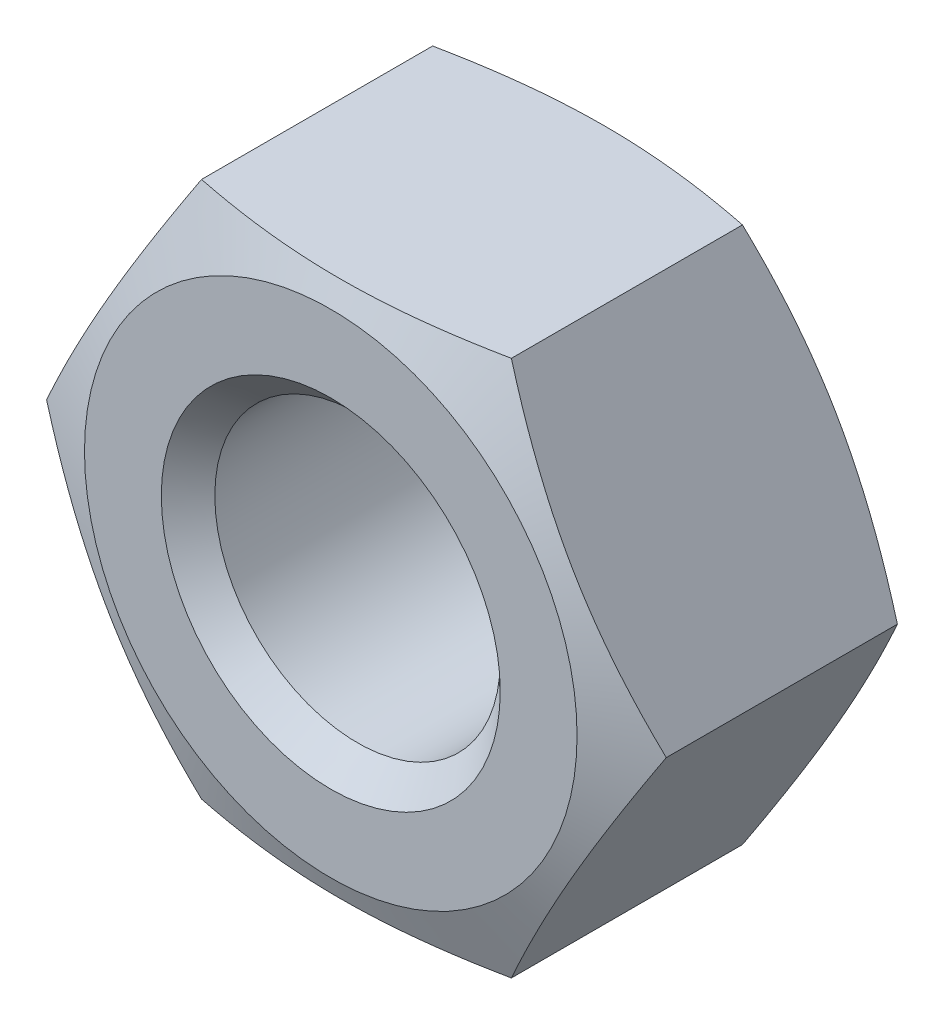
ISO-10303-21;
HEADER;
FILE_DESCRIPTION(('STEP AP214'),'2;1');
FILE_NAME('part.step','',(''),(''),'','','');
FILE_SCHEMA(('AUTOMOTIVE_DESIGN { 1 0 10303 214 1 1 1 1 }'));
ENDSEC;
DATA;
#1=APPLICATION_CONTEXT('core data for automotive mechanical design processes');
#2=APPLICATION_PROTOCOL_DEFINITION('international standard','automotive_design',2000,#1);
#3=PRODUCT_CONTEXT('',#1,'mechanical');
#4=PRODUCT('Part','Part','',(#3));
#5=PRODUCT_RELATED_PRODUCT_CATEGORY('part','',(#4));
#6=PRODUCT_DEFINITION_FORMATION('','',#4);
#7=PRODUCT_DEFINITION_CONTEXT('part definition',#1,'design');
#8=PRODUCT_DEFINITION('design','',#6,#7);
#9=PRODUCT_DEFINITION_SHAPE('','',#8);
#10=(LENGTH_UNIT() NAMED_UNIT(*) SI_UNIT(.MILLI.,.METRE.));
#11=(NAMED_UNIT(*) PLANE_ANGLE_UNIT() SI_UNIT($,.RADIAN.));
#12=(NAMED_UNIT(*) SI_UNIT($,.STERADIAN.) SOLID_ANGLE_UNIT());
#13=UNCERTAINTY_MEASURE_WITH_UNIT(LENGTH_MEASURE(1.E-05),#10,'distance_accuracy_value','');
#14=(GEOMETRIC_REPRESENTATION_CONTEXT(3) GLOBAL_UNCERTAINTY_ASSIGNED_CONTEXT((#13)) GLOBAL_UNIT_ASSIGNED_CONTEXT((#10,
#11,#12)) REPRESENTATION_CONTEXT('',''));
#15=CARTESIAN_POINT('',(0.,0.,0.));
#16=DIRECTION('',(0.,0.,1.));
#17=DIRECTION('',(1.,0.,0.));
#18=AXIS2_PLACEMENT_3D('',#15,#16,#17);
#19=CARTESIAN_POINT('',(-8.22723749999765,-4.74999778531182,-3.10862446895044E-12));
#20=DIRECTION('',(-0.866025403784438,-0.500000000000001,0.));
#21=DIRECTION('',(0.500000000000001,-0.866025403784438,0.));
#22=AXIS2_PLACEMENT_3D('',#19,#20,#21);
#23=PLANE('',#22);
#24=CARTESIAN_POINT('',(-10.9696499999969,3.10862446895044E-12,9.09090909090571));
#25=CARTESIAN_POINT('',(-8.22723750000031,-4.74999778531173,10.1989156629664));
#26=CARTESIAN_POINT('',(-5.48482499999881,-9.49999557062031,9.09090909090571));
#27=(BOUNDED_CURVE() B_SPLINE_CURVE(2,(#24,#25,#26),.UNSPECIFIED.,.F.,
.F.) B_SPLINE_CURVE_WITH_KNOTS((3,3),(0.,11.0337443691916),
.UNSPECIFIED.) CURVE() GEOMETRIC_REPRESENTATION_ITEM() RATIONAL_B_SPLINE_CURVE((1.,
1.15470053837925,1.)) REPRESENTATION_ITEM(''));
#28=CARTESIAN_POINT('',(-10.9696499999969,3.10862446895044E-12,9.09090909090571));
#29=VERTEX_POINT('',#28);
#30=CARTESIAN_POINT('',(-5.48482499999881,-9.49999557062031,9.09090909090571));
#31=VERTEX_POINT('',#30);
#32=EDGE_CURVE('E242',#29,#31,#27,.T.);
#33=ORIENTED_EDGE('',*,*,#32,.F.);
#34=DIRECTION('',(0.,0.,1.));
#35=VECTOR('',#34,1.);
#36=CARTESIAN_POINT('',(-10.9696500000003,2.22044604925031E-13,-3.10862446895044E-12));
#37=LINE('',#36,#35);
#38=CARTESIAN_POINT('',(-10.9696499999996,2.22044604925031E-13,0.909090909087862));
#39=VERTEX_POINT('',#38);
#40=EDGE_CURVE('E188',#39,#29,#37,.T.);
#41=ORIENTED_EDGE('',*,*,#40,.F.);
#42=CARTESIAN_POINT('',(-5.48482499999814,-9.49999557062475,0.909090909087418));
#43=CARTESIAN_POINT('',(-8.22723749999875,-4.74999778531152,-0.198915662963352));
#44=CARTESIAN_POINT('',(-10.9696499999996,2.22044604925031E-13,0.909090909087862));
#45=(BOUNDED_CURVE() B_SPLINE_CURVE(2,(#42,#43,#44),.UNSPECIFIED.,.F.,
.F.) B_SPLINE_CURVE_WITH_KNOTS((3,3),(0.,11.0337443691916),
.UNSPECIFIED.) CURVE() GEOMETRIC_REPRESENTATION_ITEM() RATIONAL_B_SPLINE_CURVE((1.,
1.15470053837925,1.)) REPRESENTATION_ITEM(''));
#46=CARTESIAN_POINT('',(-5.48482499999814,-9.49999557062475,0.909090909087418));
#47=VERTEX_POINT('',#46);
#48=EDGE_CURVE('E121',#47,#39,#45,.T.);
#49=ORIENTED_EDGE('',*,*,#48,.F.);
#50=DIRECTION('',(0.,0.,1.));
#51=VECTOR('',#50,1.);
#52=CARTESIAN_POINT('',(-5.48482499999992,-9.49999557062409,-3.5527136788005E-12));
#53=LINE('',#52,#51);
#54=EDGE_CURVE('E11',#47,#31,#53,.T.);
#55=ORIENTED_EDGE('',*,*,#54,.T.);
#56=EDGE_LOOP('',(#33,#41,#49,#55));
#57=FACE_BOUND('',#56,.T.);
#58=ADVANCED_FACE('F17',(#57),#23,.T.);
#59=CARTESIAN_POINT('',(1.33226762955019E-12,-9.49999557062098,4.44089209850063E-13));
#60=DIRECTION('',(0.,-1.,0.));
#61=DIRECTION('',(1.,0.,0.));
#62=AXIS2_PLACEMENT_3D('',#59,#60,#61);
#63=PLANE('',#62);
#64=CARTESIAN_POINT('',(-5.48482499999881,-9.49999557062031,9.09090909090571));
#65=CARTESIAN_POINT('',(4.99970298459727E-12,-9.4999955706271,10.1989156629643));
#66=CARTESIAN_POINT('',(5.48482500000391,-9.49999557062187,9.0909090909026));
#67=(BOUNDED_CURVE() B_SPLINE_CURVE(2,(#64,#65,#66),.UNSPECIFIED.,.F.,
.F.) B_SPLINE_CURVE_WITH_KNOTS((3,3),(0.,11.0337443691915),
.UNSPECIFIED.) CURVE() GEOMETRIC_REPRESENTATION_ITEM() RATIONAL_B_SPLINE_CURVE((1.,
1.15470053837925,1.)) REPRESENTATION_ITEM(''));
#68=CARTESIAN_POINT('',(5.48482500000391,-9.49999557062187,9.0909090909026));
#69=VERTEX_POINT('',#68);
#70=EDGE_CURVE('E145',#31,#69,#67,.T.);
#71=ORIENTED_EDGE('',*,*,#70,.F.);
#72=ORIENTED_EDGE('',*,*,#54,.F.);
#73=CARTESIAN_POINT('',(5.48482500000169,-9.4999955706252,0.909090909084309));
#74=CARTESIAN_POINT('',(4.4228141786822E-12,-9.49999557062651,-0.198915662968928));
#75=CARTESIAN_POINT('',(-5.48482499999814,-9.49999557062475,0.909090909087418));
#76=(BOUNDED_CURVE() B_SPLINE_CURVE(2,(#73,#74,#75),.UNSPECIFIED.,.F.,
.F.) B_SPLINE_CURVE_WITH_KNOTS((3,3),(0.,11.0337443691916),
.UNSPECIFIED.) CURVE() GEOMETRIC_REPRESENTATION_ITEM() RATIONAL_B_SPLINE_CURVE((1.,
1.15470053837925,1.)) REPRESENTATION_ITEM(''));
#77=CARTESIAN_POINT('',(5.48482500000169,-9.4999955706252,0.909090909084309));
#78=VERTEX_POINT('',#77);
#79=EDGE_CURVE('E115',#78,#47,#76,.T.);
#80=ORIENTED_EDGE('',*,*,#79,.F.);
#81=DIRECTION('',(0.,0.,1.));
#82=VECTOR('',#81,1.);
#83=CARTESIAN_POINT('',(5.48482500000058,-9.49999557062431,-6.66133814775094E-12));
#84=LINE('',#83,#82);
#85=EDGE_CURVE('E28',#78,#69,#84,.T.);
#86=ORIENTED_EDGE('',*,*,#85,.T.);
#87=EDGE_LOOP('',(#71,#72,#80,#86));
#88=FACE_BOUND('',#87,.T.);
#89=ADVANCED_FACE('F116',(#88),#63,.T.);
#90=CARTESIAN_POINT('',(0.,0.,0.));
#91=DIRECTION('',(0.,0.,1.));
#92=DIRECTION('',(1.,0.,0.));
#93=AXIS2_PLACEMENT_3D('',#90,#91,#92);
#94=PLANE('',#93);
#95=CARTESIAN_POINT('',(0.,0.,0.));
#96=DIRECTION('',(0.,0.,1.));
#97=DIRECTION('',(1.,0.,0.));
#98=AXIS2_PLACEMENT_3D('',#95,#96,#97);
#99=CIRCLE('',#98,8.71957104234883);
#100=CARTESIAN_POINT('',(8.71957104235177,6.66133814775094E-13,0.));
#101=VERTEX_POINT('',#100);
#102=EDGE_CURVE('E137',#101,#101,#99,.T.);
#103=ORIENTED_EDGE('',*,*,#102,.F.);
#104=EDGE_LOOP('',(#103));
#105=FACE_BOUND('',#104,.T.);
#106=CARTESIAN_POINT('',(0.,0.,0.));
#107=DIRECTION('',(0.,0.,-1.));
#108=DIRECTION('',(1.,0.,0.));
#109=AXIS2_PLACEMENT_3D('',#106,#107,#108);
#110=CIRCLE('',#109,6.);
#111=CARTESIAN_POINT('',(6.000000000002,1.33226762955019E-12,-2.66453525910038E-12));
#112=VERTEX_POINT('',#111);
#113=EDGE_CURVE('E21',#112,#112,#110,.T.);
#114=ORIENTED_EDGE('',*,*,#113,.F.);
#115=EDGE_LOOP('',(#114));
#116=FACE_BOUND('',#115,.T.);
#117=ADVANCED_FACE('F207',(#105,#116),#94,.F.);
#118=CARTESIAN_POINT('',(-2.22044604925031E-13,6.66133814775094E-13,10.0000000000002));
#119=DIRECTION('',(0.,0.,1.));
#120=DIRECTION('',(1.,0.,0.));
#121=AXIS2_PLACEMENT_3D('',#118,#119,#120);
#122=PLANE('',#121);
#123=CARTESIAN_POINT('',(-2.22044604925031E-13,6.66133814775094E-13,10.0000000000002));
#124=DIRECTION('',(0.,0.,-1.));
#125=DIRECTION('',(1.,0.,0.));
#126=AXIS2_PLACEMENT_3D('',#123,#124,#125);
#127=CIRCLE('',#126,8.71957104234883);
#128=CARTESIAN_POINT('',(8.71957104235155,3.10862446895044E-12,9.99999999999979));
#129=VERTEX_POINT('',#128);
#130=EDGE_CURVE('E139',#129,#129,#127,.T.);
#131=ORIENTED_EDGE('',*,*,#130,.F.);
#132=EDGE_LOOP('',(#131));
#133=FACE_BOUND('',#132,.T.);
#134=CARTESIAN_POINT('',(-2.22044604925031E-13,6.66133814775094E-13,10.0000000000002));
#135=DIRECTION('',(0.,0.,1.));
#136=DIRECTION('',(1.,0.,0.));
#137=AXIS2_PLACEMENT_3D('',#134,#135,#136);
#138=CIRCLE('',#137,6.);
#139=CARTESIAN_POINT('',(5.99999999999978,-4.44089209850063E-13,9.99999999999757));
#140=VERTEX_POINT('',#139);
#141=EDGE_CURVE('E185',#140,#140,#138,.T.);
#142=ORIENTED_EDGE('',*,*,#141,.F.);
#143=EDGE_LOOP('',(#142));
#144=FACE_BOUND('',#143,.T.);
#145=ADVANCED_FACE('F210',(#133,#144),#122,.T.);
#146=CARTESIAN_POINT('',(8.22723750000076,-4.74999778531227,-6.66133814775094E-12));
#147=DIRECTION('',(0.866025403784441,-0.500000000000002,0.));
#148=DIRECTION('',(0.500000000000002,0.866025403784441,0.));
#149=AXIS2_PLACEMENT_3D('',#146,#147,#148);
#150=PLANE('',#149);
#151=CARTESIAN_POINT('',(5.48482500000391,-9.49999557062187,9.0909090909026));
#152=CARTESIAN_POINT('',(8.22723750000334,-4.74999778530978,10.1989156629708));
#153=CARTESIAN_POINT('',(10.9696500000007,4.44089209850063E-13,9.09090909090882));
#154=(BOUNDED_CURVE() B_SPLINE_CURVE(2,(#151,#152,#153),.UNSPECIFIED.,.F.,
.F.) B_SPLINE_CURVE_WITH_KNOTS((3,3),(0.,11.0337443691916),
.UNSPECIFIED.) CURVE() GEOMETRIC_REPRESENTATION_ITEM() RATIONAL_B_SPLINE_CURVE((1.,
1.15470053837926,1.)) REPRESENTATION_ITEM(''));
#155=CARTESIAN_POINT('',(10.9696500000007,4.44089209850063E-13,9.09090909090882));
#156=VERTEX_POINT('',#155);
#157=EDGE_CURVE('E111',#69,#156,#154,.T.);
#158=ORIENTED_EDGE('',*,*,#157,.F.);
#159=ORIENTED_EDGE('',*,*,#85,.F.);
#160=CARTESIAN_POINT('',(10.9696499999998,-8.88178419700125E-13,0.909090909090526));
#161=CARTESIAN_POINT('',(8.22723750000547,-4.74999778531267,-0.19891566296989));
#162=CARTESIAN_POINT('',(5.48482500000169,-9.4999955706252,0.909090909084309));
#163=(BOUNDED_CURVE() B_SPLINE_CURVE(2,(#160,#161,#162),.UNSPECIFIED.,.F.,
.F.) B_SPLINE_CURVE_WITH_KNOTS((3,3),(0.,11.0337443691916),
.UNSPECIFIED.) CURVE() GEOMETRIC_REPRESENTATION_ITEM() RATIONAL_B_SPLINE_CURVE((1.,
1.15470053837925,1.)) REPRESENTATION_ITEM(''));
#164=CARTESIAN_POINT('',(10.9696499999998,-8.88178419700125E-13,0.909090909090526));
#165=VERTEX_POINT('',#164);
#166=EDGE_CURVE('E109',#165,#78,#163,.T.);
#167=ORIENTED_EDGE('',*,*,#166,.F.);
#168=DIRECTION('',(0.,0.,1.));
#169=VECTOR('',#168,1.);
#170=CARTESIAN_POINT('',(10.9696500000005,4.44089209850063E-13,0.));
#171=LINE('',#170,#169);
#172=EDGE_CURVE('E76',#165,#156,#171,.T.);
#173=ORIENTED_EDGE('',*,*,#172,.T.);
#174=EDGE_LOOP('',(#158,#159,#167,#173));
#175=FACE_BOUND('',#174,.T.);
#176=ADVANCED_FACE('F107',(#175),#150,.T.);
#177=CARTESIAN_POINT('',(8.22723749999987,4.7499977853116,0.));
#178=DIRECTION('',(0.866025403784438,0.500000000000001,0.));
#179=DIRECTION('',(-0.500000000000001,0.866025403784438,0.));
#180=AXIS2_PLACEMENT_3D('',#177,#178,#179);
#181=PLANE('',#180);
#182=CARTESIAN_POINT('',(10.9696500000007,4.44089209850063E-13,9.09090909090882));
#183=CARTESIAN_POINT('',(8.22723750000222,4.74999778530479,10.1989156629687));
#184=CARTESIAN_POINT('',(5.48482500000236,9.49999557062609,9.09090909091259));
#185=(BOUNDED_CURVE() B_SPLINE_CURVE(2,(#182,#183,#184),.UNSPECIFIED.,.F.,
.F.) B_SPLINE_CURVE_WITH_KNOTS((3,3),(0.,11.0337443691916),
.UNSPECIFIED.) CURVE() GEOMETRIC_REPRESENTATION_ITEM() RATIONAL_B_SPLINE_CURVE((1.,
1.15470053837925,1.)) REPRESENTATION_ITEM(''));
#186=CARTESIAN_POINT('',(5.48482500000258,9.49999557062564,9.09090909091259));
#187=VERTEX_POINT('',#186);
#188=EDGE_CURVE('E178',#156,#187,#185,.T.);
#189=ORIENTED_EDGE('',*,*,#188,.F.);
#190=ORIENTED_EDGE('',*,*,#172,.F.);
#191=CARTESIAN_POINT('',(5.48482500000191,9.49999557062298,0.909090909094301));
#192=CARTESIAN_POINT('',(8.22723750000355,4.74999778530921,-0.198915662970274));
#193=CARTESIAN_POINT('',(10.9696499999998,-8.88178419700125E-13,0.909090909090526));
#194=(BOUNDED_CURVE() B_SPLINE_CURVE(2,(#191,#192,#193),.UNSPECIFIED.,.F.,
.F.) B_SPLINE_CURVE_WITH_KNOTS((3,3),(0.,11.0337443691916),
.UNSPECIFIED.) CURVE() GEOMETRIC_REPRESENTATION_ITEM() RATIONAL_B_SPLINE_CURVE((1.,
1.15470053837925,1.)) REPRESENTATION_ITEM(''));
#195=CARTESIAN_POINT('',(5.48482500000191,9.49999557062298,0.909090909094301));
#196=VERTEX_POINT('',#195);
#197=EDGE_CURVE('E127',#196,#165,#194,.T.);
#198=ORIENTED_EDGE('',*,*,#197,.F.);
#199=DIRECTION('',(0.,0.,1.));
#200=VECTOR('',#199,1.);
#201=CARTESIAN_POINT('',(5.48482500000302,9.4999955706232,3.33066907387547E-12));
#202=LINE('',#201,#200);
#203=EDGE_CURVE('E186',#196,#187,#202,.T.);
#204=ORIENTED_EDGE('',*,*,#203,.T.);
#205=EDGE_LOOP('',(#189,#190,#198,#204));
#206=FACE_BOUND('',#205,.T.);
#207=ADVANCED_FACE('F282',(#206),#181,.T.);
#208=CARTESIAN_POINT('',(2.44249065417534E-12,9.49999557062342,-6.21724893790088E-12));
#209=DIRECTION('',(0.,1.,0.));
#210=DIRECTION('',(-1.,0.,0.));
#211=AXIS2_PLACEMENT_3D('',#208,#209,#210);
#212=PLANE('',#211);
#213=CARTESIAN_POINT('',(5.48482500000258,9.49999557062564,9.09090909091259));
#214=CARTESIAN_POINT('',(1.15377761183014E-12,9.49999557061786,10.1989156629626));
#215=CARTESIAN_POINT('',(-5.48482499999992,9.49999557062431,9.09090909091015));
#216=(BOUNDED_CURVE() B_SPLINE_CURVE(2,(#213,#214,#215),.UNSPECIFIED.,.F.,
.F.) B_SPLINE_CURVE_WITH_KNOTS((3,3),(0.,11.0337443691916),
.UNSPECIFIED.) CURVE() GEOMETRIC_REPRESENTATION_ITEM() RATIONAL_B_SPLINE_CURVE((1.,
1.15470053837925,1.)) REPRESENTATION_ITEM(''));
#217=CARTESIAN_POINT('',(-5.48482499999992,9.49999557062431,9.09090909091015));
#218=VERTEX_POINT('',#217);
#219=EDGE_CURVE('E168',#187,#218,#216,.T.);
#220=ORIENTED_EDGE('',*,*,#219,.F.);
#221=ORIENTED_EDGE('',*,*,#203,.F.);
#222=CARTESIAN_POINT('',(-5.48482499999992,9.49999557062386,0.909090909091859));
#223=CARTESIAN_POINT('',(1.92296268638356E-13,9.49999557062188,-0.198915662978735));
#224=CARTESIAN_POINT('',(5.48482500000191,9.49999557062298,0.909090909094301));
#225=(BOUNDED_CURVE() B_SPLINE_CURVE(2,(#222,#223,#224),.UNSPECIFIED.,.F.,
.F.) B_SPLINE_CURVE_WITH_KNOTS((3,3),(0.,11.0337443691916),
.UNSPECIFIED.) CURVE() GEOMETRIC_REPRESENTATION_ITEM() RATIONAL_B_SPLINE_CURVE((1.,
1.15470053837925,1.)) REPRESENTATION_ITEM(''));
#226=CARTESIAN_POINT('',(-5.48482499999992,9.49999557062386,0.909090909091859));
#227=VERTEX_POINT('',#226);
#228=EDGE_CURVE('E147',#227,#196,#225,.T.);
#229=ORIENTED_EDGE('',*,*,#228,.F.);
#230=DIRECTION('',(0.,0.,1.));
#231=VECTOR('',#230,1.);
#232=CARTESIAN_POINT('',(-5.48482499999903,9.4999955706252,8.88178419700125E-13));
#233=LINE('',#232,#231);
#234=EDGE_CURVE('E213',#227,#218,#233,.T.);
#235=ORIENTED_EDGE('',*,*,#234,.T.);
#236=EDGE_LOOP('',(#220,#221,#229,#235));
#237=FACE_BOUND('',#236,.T.);
#238=ADVANCED_FACE('F280',(#237),#212,.T.);
#239=CARTESIAN_POINT('',(-8.22723749999943,4.74999778531315,3.5527136788005E-12));
#240=DIRECTION('',(-0.866025403784441,0.500000000000002,0.));
#241=DIRECTION('',(-0.500000000000002,-0.866025403784441,0.));
#242=AXIS2_PLACEMENT_3D('',#239,#240,#241);
#243=PLANE('',#242);
#244=CARTESIAN_POINT('',(-5.48482499999992,9.49999557062431,9.09090909091015));
#245=CARTESIAN_POINT('',(-8.22723749999954,4.74999778531076,10.1989156629587));
#246=CARTESIAN_POINT('',(-10.9696499999969,3.10862446895044E-12,9.09090909090571));
#247=(BOUNDED_CURVE() B_SPLINE_CURVE(2,(#244,#245,#246),.UNSPECIFIED.,.F.,
.F.) B_SPLINE_CURVE_WITH_KNOTS((3,3),(0.,11.0337443691916),
.UNSPECIFIED.) CURVE() GEOMETRIC_REPRESENTATION_ITEM() RATIONAL_B_SPLINE_CURVE((1.,
1.15470053837925,1.)) REPRESENTATION_ITEM(''));
#248=EDGE_CURVE('E177',#218,#29,#247,.T.);
#249=ORIENTED_EDGE('',*,*,#248,.F.);
#250=ORIENTED_EDGE('',*,*,#234,.F.);
#251=CARTESIAN_POINT('',(-10.9696499999996,2.22044604925031E-13,0.909090909087862));
#252=CARTESIAN_POINT('',(-8.22723749999972,4.7499977853121,-0.198915662969505));
#253=CARTESIAN_POINT('',(-5.48482499999992,9.49999557062386,0.909090909091859));
#254=(BOUNDED_CURVE() B_SPLINE_CURVE(2,(#251,#252,#253),.UNSPECIFIED.,.F.,
.F.) B_SPLINE_CURVE_WITH_KNOTS((3,3),(0.,11.0337443691916),
.UNSPECIFIED.) CURVE() GEOMETRIC_REPRESENTATION_ITEM() RATIONAL_B_SPLINE_CURVE((1.,
1.15470053837925,1.)) REPRESENTATION_ITEM(''));
#255=EDGE_CURVE('E152',#39,#227,#254,.T.);
#256=ORIENTED_EDGE('',*,*,#255,.F.);
#257=ORIENTED_EDGE('',*,*,#40,.T.);
#258=EDGE_LOOP('',(#249,#250,#256,#257));
#259=FACE_BOUND('',#258,.T.);
#260=ADVANCED_FACE('F279',(#259),#243,.T.);
#261=CARTESIAN_POINT('',(1.55431223447522E-12,5.10702591327572E-12,0.473593750000223));
#262=DIRECTION('',(0.,0.,-1.));
#263=DIRECTION('',(1.,0.,0.));
#264=AXIS2_PLACEMENT_3D('',#261,#262,#263);
#265=CONICAL_SURFACE('',#264,5.52640625,0.785398163397448);
#266=CARTESIAN_POINT('',(4.44089209850063E-13,4.44089209850063E-13,0.947187500000002));
#267=DIRECTION('',(0.,0.,1.));
#268=DIRECTION('',(1.,0.,0.));
#269=AXIS2_PLACEMENT_3D('',#266,#267,#268);
#270=CIRCLE('',#269,5.0528125);
#271=CARTESIAN_POINT('',(5.052812500002,-3.5527136788005E-12,0.947187499997337));
#272=VERTEX_POINT('',#271);
#273=EDGE_CURVE('E179',#272,#272,#270,.T.);
#274=ORIENTED_EDGE('',*,*,#273,.T.);
#275=EDGE_LOOP('',(#274));
#276=FACE_BOUND('',#275,.T.);
#277=ORIENTED_EDGE('',*,*,#113,.T.);
#278=EDGE_LOOP('',(#277));
#279=FACE_BOUND('',#278,.T.);
#280=ADVANCED_FACE('F306',(#276,#279),#265,.F.);
#281=CARTESIAN_POINT('',(2.66453525910038E-12,-3.33066907387547E-12,4.99999999999989));
#282=DIRECTION('',(0.,0.,-1.));
#283=DIRECTION('',(1.,0.,0.));
#284=AXIS2_PLACEMENT_3D('',#281,#282,#283);
#285=CYLINDRICAL_SURFACE('',#284,5.0528125);
#286=CARTESIAN_POINT('',(0.,6.66133814775094E-13,9.05281249999978));
#287=DIRECTION('',(0.,0.,1.));
#288=DIRECTION('',(1.,0.,0.));
#289=AXIS2_PLACEMENT_3D('',#286,#287,#288);
#290=CIRCLE('',#289,5.0528125);
#291=CARTESIAN_POINT('',(5.05281250000023,-4.44089209850063E-13,9.05281249999756));
#292=VERTEX_POINT('',#291);
#293=EDGE_CURVE('E144',#292,#292,#290,.T.);
#294=ORIENTED_EDGE('',*,*,#293,.T.);
#295=EDGE_LOOP('',(#294));
#296=FACE_BOUND('',#295,.T.);
#297=ORIENTED_EDGE('',*,*,#273,.F.);
#298=EDGE_LOOP('',(#297));
#299=FACE_BOUND('',#298,.T.);
#300=ADVANCED_FACE('F295',(#296,#299),#285,.F.);
#301=CARTESIAN_POINT('',(2.66453525910038E-12,-2.22044604925031E-13,9.52640625000001));
#302=DIRECTION('',(0.,0.,1.));
#303=DIRECTION('',(1.,0.,0.));
#304=AXIS2_PLACEMENT_3D('',#301,#302,#303);
#305=CONICAL_SURFACE('',#304,5.52640625,0.785398163397448);
#306=ORIENTED_EDGE('',*,*,#141,.T.);
#307=EDGE_LOOP('',(#306));
#308=FACE_BOUND('',#307,.T.);
#309=ORIENTED_EDGE('',*,*,#293,.F.);
#310=EDGE_LOOP('',(#309));
#311=FACE_BOUND('',#310,.T.);
#312=ADVANCED_FACE('F287',(#308,#311),#305,.F.);
#313=CARTESIAN_POINT('',(0.,8.88178419700125E-13,9.5454545454543));
#314=DIRECTION('',(0.,0.,-1.));
#315=DIRECTION('',(1.,0.,0.));
#316=AXIS2_PLACEMENT_3D('',#313,#314,#315);
#317=CONICAL_SURFACE('',#316,9.84461052117441,1.18682389135614);
#318=ORIENTED_EDGE('',*,*,#130,.T.);
#319=EDGE_LOOP('',(#318));
#320=FACE_BOUND('',#319,.T.);
#321=ORIENTED_EDGE('',*,*,#157,.T.);
#322=ORIENTED_EDGE('',*,*,#188,.T.);
#323=ORIENTED_EDGE('',*,*,#219,.T.);
#324=ORIENTED_EDGE('',*,*,#248,.T.);
#325=ORIENTED_EDGE('',*,*,#32,.T.);
#326=ORIENTED_EDGE('',*,*,#70,.T.);
#327=EDGE_LOOP('',(#321,#322,#323,#324,#325,#326));
#328=FACE_BOUND('',#327,.T.);
#329=ADVANCED_FACE('F19',(#320,#328),#317,.T.);
#330=CARTESIAN_POINT('',(0.,0.,0.454545454545485));
#331=DIRECTION('',(0.,0.,1.));
#332=DIRECTION('',(1.,0.,0.));
#333=AXIS2_PLACEMENT_3D('',#330,#331,#332);
#334=CONICAL_SURFACE('',#333,9.84461052117441,1.18682389135614);
#335=ORIENTED_EDGE('',*,*,#102,.T.);
#336=EDGE_LOOP('',(#335));
#337=FACE_BOUND('',#336,.T.);
#338=ORIENTED_EDGE('',*,*,#166,.T.);
#339=ORIENTED_EDGE('',*,*,#79,.T.);
#340=ORIENTED_EDGE('',*,*,#48,.T.);
#341=ORIENTED_EDGE('',*,*,#255,.T.);
#342=ORIENTED_EDGE('',*,*,#228,.T.);
#343=ORIENTED_EDGE('',*,*,#197,.T.);
#344=EDGE_LOOP('',(#338,#339,#340,#341,#342,#343));
#345=FACE_BOUND('',#344,.T.);
#346=ADVANCED_FACE('F124',(#337,#345),#334,.T.);
#347=CLOSED_SHELL('',(#58,#89,#117,#145,#176,#207,#238,#260,#280,#300,#312,#329,#346));
#348=MANIFOLD_SOLID_BREP('B1',#347);
#349=ADVANCED_BREP_SHAPE_REPRESENTATION('',(#18,#348),#14);
#350=SHAPE_DEFINITION_REPRESENTATION(#9,#349);
ENDSEC;
END-ISO-10303-21;
